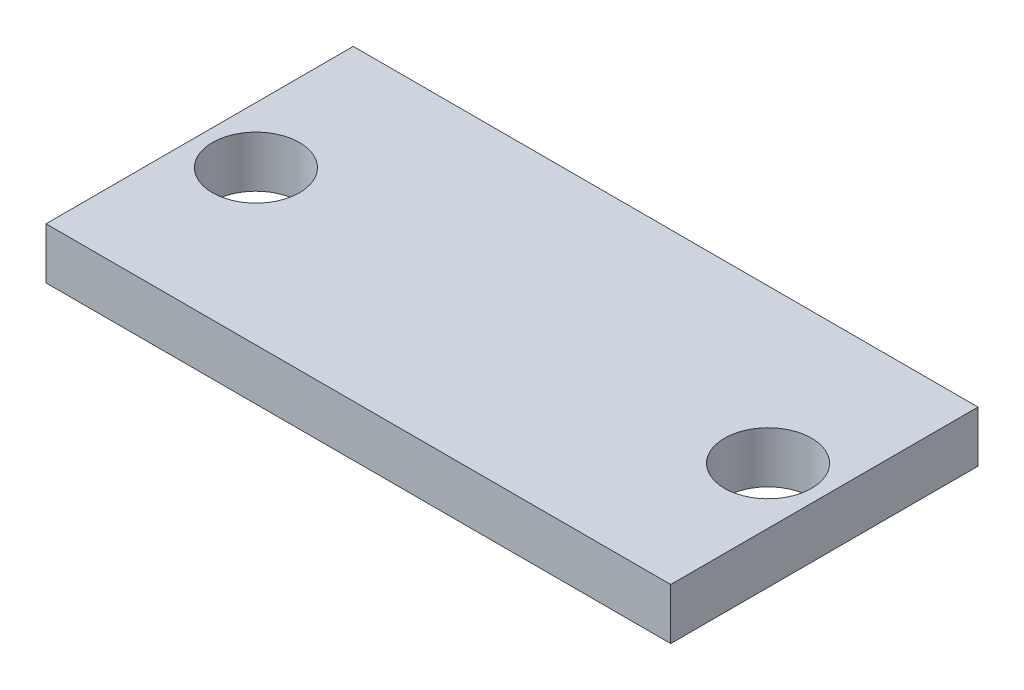
ISO-10303-21;
HEADER;
FILE_DESCRIPTION(('STEP AP214'),'2;1');
FILE_NAME('part.step','',(''),(''),'','','');
FILE_SCHEMA(('AUTOMOTIVE_DESIGN { 1 0 10303 214 1 1 1 1 }'));
ENDSEC;
DATA;
#1=APPLICATION_CONTEXT('core data for automotive mechanical design processes');
#2=APPLICATION_PROTOCOL_DEFINITION('international standard','automotive_design',2000,#1);
#3=PRODUCT_CONTEXT('',#1,'mechanical');
#4=PRODUCT('Part','Part','',(#3));
#5=PRODUCT_RELATED_PRODUCT_CATEGORY('part','',(#4));
#6=PRODUCT_DEFINITION_FORMATION('','',#4);
#7=PRODUCT_DEFINITION_CONTEXT('part definition',#1,'design');
#8=PRODUCT_DEFINITION('design','',#6,#7);
#9=PRODUCT_DEFINITION_SHAPE('','',#8);
#10=(LENGTH_UNIT() NAMED_UNIT(*) SI_UNIT(.MILLI.,.METRE.));
#11=(NAMED_UNIT(*) PLANE_ANGLE_UNIT() SI_UNIT($,.RADIAN.));
#12=(NAMED_UNIT(*) SI_UNIT($,.STERADIAN.) SOLID_ANGLE_UNIT());
#13=UNCERTAINTY_MEASURE_WITH_UNIT(LENGTH_MEASURE(1.E-05),#10,'distance_accuracy_value','');
#14=(GEOMETRIC_REPRESENTATION_CONTEXT(3) GLOBAL_UNCERTAINTY_ASSIGNED_CONTEXT((#13)) GLOBAL_UNIT_ASSIGNED_CONTEXT((#10,
#11,#12)) REPRESENTATION_CONTEXT('',''));
#15=CARTESIAN_POINT('',(0.,0.,0.));
#16=DIRECTION('',(0.,0.,1.));
#17=DIRECTION('',(1.,0.,0.));
#18=AXIS2_PLACEMENT_3D('',#15,#16,#17);
#19=CARTESIAN_POINT('',(0.,2.,-6.));
#20=DIRECTION('',(0.,0.,-1.));
#21=DIRECTION('',(-1.,0.,0.));
#22=AXIS2_PLACEMENT_3D('',#19,#20,#21);
#23=PLANE('',#22);
#24=DIRECTION('',(1.,0.,0.));
#25=VECTOR('',#24,1.);
#26=CARTESIAN_POINT('',(0.,0.,-6.));
#27=LINE('',#26,#25);
#28=CARTESIAN_POINT('',(-12.2,0.,-6.));
#29=VERTEX_POINT('',#28);
#30=CARTESIAN_POINT('',(12.2,0.,-6.));
#31=VERTEX_POINT('',#30);
#32=EDGE_CURVE('E107',#29,#31,#27,.T.);
#33=ORIENTED_EDGE('',*,*,#32,.F.);
#34=DIRECTION('',(0.,-1.,0.));
#35=VECTOR('',#34,1.);
#36=CARTESIAN_POINT('',(-12.2,2.,-6.));
#37=LINE('',#36,#35);
#38=CARTESIAN_POINT('',(-12.2,2.,-6.));
#39=VERTEX_POINT('',#38);
#40=EDGE_CURVE('E11',#39,#29,#37,.T.);
#41=ORIENTED_EDGE('',*,*,#40,.F.);
#42=DIRECTION('',(1.,0.,0.));
#43=VECTOR('',#42,1.);
#44=CARTESIAN_POINT('',(0.,2.,-6.));
#45=LINE('',#44,#43);
#46=CARTESIAN_POINT('',(12.2,2.,-6.));
#47=VERTEX_POINT('',#46);
#48=EDGE_CURVE('E86',#39,#47,#45,.T.);
#49=ORIENTED_EDGE('',*,*,#48,.T.);
#50=DIRECTION('',(0.,-1.,0.));
#51=VECTOR('',#50,1.);
#52=CARTESIAN_POINT('',(12.2,2.,-6.));
#53=LINE('',#52,#51);
#54=EDGE_CURVE('E53',#47,#31,#53,.T.);
#55=ORIENTED_EDGE('',*,*,#54,.T.);
#56=EDGE_LOOP('',(#33,#41,#49,#55));
#57=FACE_BOUND('',#56,.T.);
#58=ADVANCED_FACE('F37',(#57),#23,.T.);
#59=CARTESIAN_POINT('',(-12.2,2.,0.));
#60=DIRECTION('',(1.,0.,0.));
#61=DIRECTION('',(0.,0.,-1.));
#62=AXIS2_PLACEMENT_3D('',#59,#60,#61);
#63=PLANE('',#62);
#64=DIRECTION('',(0.,0.,1.));
#65=VECTOR('',#64,1.);
#66=CARTESIAN_POINT('',(-12.2,0.,0.));
#67=LINE('',#66,#65);
#68=CARTESIAN_POINT('',(-12.2,0.,6.));
#69=VERTEX_POINT('',#68);
#70=EDGE_CURVE('E92',#29,#69,#67,.T.);
#71=ORIENTED_EDGE('',*,*,#70,.T.);
#72=DIRECTION('',(0.,-1.,0.));
#73=VECTOR('',#72,1.);
#74=CARTESIAN_POINT('',(-12.2,2.,6.));
#75=LINE('',#74,#73);
#76=CARTESIAN_POINT('',(-12.2,2.,6.));
#77=VERTEX_POINT('',#76);
#78=EDGE_CURVE('E45',#77,#69,#75,.T.);
#79=ORIENTED_EDGE('',*,*,#78,.F.);
#80=DIRECTION('',(0.,0.,1.));
#81=VECTOR('',#80,1.);
#82=CARTESIAN_POINT('',(-12.2,2.,0.));
#83=LINE('',#82,#81);
#84=EDGE_CURVE('E79',#39,#77,#83,.T.);
#85=ORIENTED_EDGE('',*,*,#84,.F.);
#86=ORIENTED_EDGE('',*,*,#40,.T.);
#87=EDGE_LOOP('',(#71,#79,#85,#86));
#88=FACE_BOUND('',#87,.T.);
#89=ADVANCED_FACE('F90',(#88),#63,.F.);
#90=CARTESIAN_POINT('',(0.,2.,6.));
#91=DIRECTION('',(0.,0.,-1.));
#92=DIRECTION('',(-1.,0.,0.));
#93=AXIS2_PLACEMENT_3D('',#90,#91,#92);
#94=PLANE('',#93);
#95=DIRECTION('',(1.,0.,0.));
#96=VECTOR('',#95,1.);
#97=CARTESIAN_POINT('',(0.,0.,6.));
#98=LINE('',#97,#96);
#99=CARTESIAN_POINT('',(12.2,0.,6.));
#100=VERTEX_POINT('',#99);
#101=EDGE_CURVE('E110',#69,#100,#98,.T.);
#102=ORIENTED_EDGE('',*,*,#101,.T.);
#103=DIRECTION('',(0.,-1.,0.));
#104=VECTOR('',#103,1.);
#105=CARTESIAN_POINT('',(12.2,2.,6.));
#106=LINE('',#105,#104);
#107=CARTESIAN_POINT('',(12.2,2.,6.));
#108=VERTEX_POINT('',#107);
#109=EDGE_CURVE('E67',#108,#100,#106,.T.);
#110=ORIENTED_EDGE('',*,*,#109,.F.);
#111=DIRECTION('',(1.,0.,0.));
#112=VECTOR('',#111,1.);
#113=CARTESIAN_POINT('',(0.,2.,6.));
#114=LINE('',#113,#112);
#115=EDGE_CURVE('E85',#77,#108,#114,.T.);
#116=ORIENTED_EDGE('',*,*,#115,.F.);
#117=ORIENTED_EDGE('',*,*,#78,.T.);
#118=EDGE_LOOP('',(#102,#110,#116,#117));
#119=FACE_BOUND('',#118,.T.);
#120=ADVANCED_FACE('F95',(#119),#94,.F.);
#121=CARTESIAN_POINT('',(10.,2.,0.));
#122=DIRECTION('',(0.,-1.,0.));
#123=DIRECTION('',(0.,0.,-1.));
#124=AXIS2_PLACEMENT_3D('',#121,#122,#123);
#125=CYLINDRICAL_SURFACE('',#124,1.7);
#126=CARTESIAN_POINT('',(10.,2.,0.));
#127=DIRECTION('',(0.,1.,0.));
#128=DIRECTION('',(0.,0.,1.));
#129=AXIS2_PLACEMENT_3D('',#126,#127,#128);
#130=CIRCLE('',#129,1.7);
#131=CARTESIAN_POINT('',(10.,2.,1.7));
#132=VERTEX_POINT('',#131);
#133=EDGE_CURVE('E98',#132,#132,#130,.T.);
#134=ORIENTED_EDGE('',*,*,#133,.T.);
#135=EDGE_LOOP('',(#134));
#136=FACE_BOUND('',#135,.T.);
#137=CARTESIAN_POINT('',(10.,0.,0.));
#138=DIRECTION('',(0.,1.,0.));
#139=DIRECTION('',(0.,0.,1.));
#140=AXIS2_PLACEMENT_3D('',#137,#138,#139);
#141=CIRCLE('',#140,1.7);
#142=CARTESIAN_POINT('',(10.,0.,1.7));
#143=VERTEX_POINT('',#142);
#144=EDGE_CURVE('E115',#143,#143,#141,.T.);
#145=ORIENTED_EDGE('',*,*,#144,.F.);
#146=EDGE_LOOP('',(#145));
#147=FACE_BOUND('',#146,.T.);
#148=ADVANCED_FACE('F127',(#136,#147),#125,.F.);
#149=CARTESIAN_POINT('',(12.2,2.,0.));
#150=DIRECTION('',(1.,0.,0.));
#151=DIRECTION('',(0.,0.,-1.));
#152=AXIS2_PLACEMENT_3D('',#149,#150,#151);
#153=PLANE('',#152);
#154=DIRECTION('',(0.,0.,1.));
#155=VECTOR('',#154,1.);
#156=CARTESIAN_POINT('',(12.2,0.,0.));
#157=LINE('',#156,#155);
#158=EDGE_CURVE('E112',#31,#100,#157,.T.);
#159=ORIENTED_EDGE('',*,*,#158,.F.);
#160=ORIENTED_EDGE('',*,*,#54,.F.);
#161=DIRECTION('',(0.,0.,1.));
#162=VECTOR('',#161,1.);
#163=CARTESIAN_POINT('',(12.2,2.,0.));
#164=LINE('',#163,#162);
#165=EDGE_CURVE('E96',#47,#108,#164,.T.);
#166=ORIENTED_EDGE('',*,*,#165,.T.);
#167=ORIENTED_EDGE('',*,*,#109,.T.);
#168=EDGE_LOOP('',(#159,#160,#166,#167));
#169=FACE_BOUND('',#168,.T.);
#170=ADVANCED_FACE('F124',(#169),#153,.T.);
#171=CARTESIAN_POINT('',(-10.,2.,0.));
#172=DIRECTION('',(0.,-1.,0.));
#173=DIRECTION('',(0.,0.,-1.));
#174=AXIS2_PLACEMENT_3D('',#171,#172,#173);
#175=CYLINDRICAL_SURFACE('',#174,1.7);
#176=CARTESIAN_POINT('',(-10.,2.,0.));
#177=DIRECTION('',(0.,1.,0.));
#178=DIRECTION('',(0.,0.,1.));
#179=AXIS2_PLACEMENT_3D('',#176,#177,#178);
#180=CIRCLE('',#179,1.7);
#181=CARTESIAN_POINT('',(-10.,2.,1.7));
#182=VERTEX_POINT('',#181);
#183=EDGE_CURVE('E104',#182,#182,#180,.F.);
#184=ORIENTED_EDGE('',*,*,#183,.F.);
#185=EDGE_LOOP('',(#184));
#186=FACE_BOUND('',#185,.T.);
#187=CARTESIAN_POINT('',(-10.,0.,0.));
#188=DIRECTION('',(0.,1.,0.));
#189=DIRECTION('',(0.,0.,1.));
#190=AXIS2_PLACEMENT_3D('',#187,#188,#189);
#191=CIRCLE('',#190,1.7);
#192=CARTESIAN_POINT('',(-10.,0.,1.7));
#193=VERTEX_POINT('',#192);
#194=EDGE_CURVE('E118',#193,#193,#191,.F.);
#195=ORIENTED_EDGE('',*,*,#194,.T.);
#196=EDGE_LOOP('',(#195));
#197=FACE_BOUND('',#196,.T.);
#198=ADVANCED_FACE('F126',(#186,#197),#175,.F.);
#199=CARTESIAN_POINT('',(0.,2.,0.));
#200=DIRECTION('',(0.,1.,0.));
#201=DIRECTION('',(0.,0.,1.));
#202=AXIS2_PLACEMENT_3D('',#199,#200,#201);
#203=PLANE('',#202);
#204=ORIENTED_EDGE('',*,*,#48,.F.);
#205=ORIENTED_EDGE('',*,*,#84,.T.);
#206=ORIENTED_EDGE('',*,*,#115,.T.);
#207=ORIENTED_EDGE('',*,*,#165,.F.);
#208=EDGE_LOOP('',(#204,#205,#206,#207));
#209=FACE_BOUND('',#208,.T.);
#210=ORIENTED_EDGE('',*,*,#133,.F.);
#211=EDGE_LOOP('',(#210));
#212=FACE_BOUND('',#211,.T.);
#213=ORIENTED_EDGE('',*,*,#183,.T.);
#214=EDGE_LOOP('',(#213));
#215=FACE_BOUND('',#214,.T.);
#216=ADVANCED_FACE('F81',(#209,#212,#215),#203,.T.);
#217=CARTESIAN_POINT('',(0.,0.,0.));
#218=DIRECTION('',(0.,1.,0.));
#219=DIRECTION('',(0.,0.,1.));
#220=AXIS2_PLACEMENT_3D('',#217,#218,#219);
#221=PLANE('',#220);
#222=ORIENTED_EDGE('',*,*,#32,.T.);
#223=ORIENTED_EDGE('',*,*,#158,.T.);
#224=ORIENTED_EDGE('',*,*,#101,.F.);
#225=ORIENTED_EDGE('',*,*,#70,.F.);
#226=EDGE_LOOP('',(#222,#223,#224,#225));
#227=FACE_BOUND('',#226,.T.);
#228=ORIENTED_EDGE('',*,*,#144,.T.);
#229=EDGE_LOOP('',(#228));
#230=FACE_BOUND('',#229,.T.);
#231=ORIENTED_EDGE('',*,*,#194,.F.);
#232=EDGE_LOOP('',(#231));
#233=FACE_BOUND('',#232,.T.);
#234=ADVANCED_FACE('F171',(#227,#230,#233),#221,.F.);
#235=CLOSED_SHELL('',(#58,#89,#120,#148,#170,#198,#216,#234));
#236=MANIFOLD_SOLID_BREP('B2',#235);
#237=ADVANCED_BREP_SHAPE_REPRESENTATION('',(#18,#236),#14);
#238=SHAPE_DEFINITION_REPRESENTATION(#9,#237);
ENDSEC;
END-ISO-10303-21;
